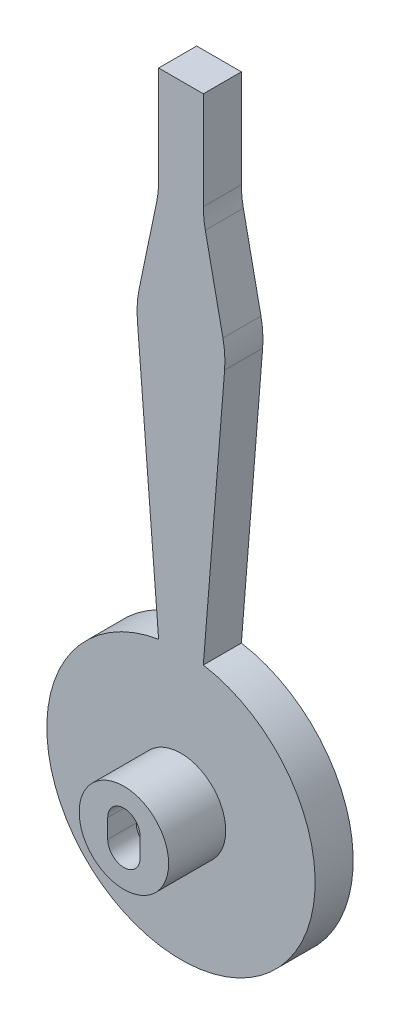
ISO-10303-21;
HEADER;
FILE_DESCRIPTION(('STEP AP214'),'2;1');
FILE_NAME('part.step','',(''),(''),'','','');
FILE_SCHEMA(('AUTOMOTIVE_DESIGN { 1 0 10303 214 1 1 1 1 }'));
ENDSEC;
DATA;
#1=APPLICATION_CONTEXT('core data for automotive mechanical design processes');
#2=APPLICATION_PROTOCOL_DEFINITION('international standard','automotive_design',2000,#1);
#3=PRODUCT_CONTEXT('',#1,'mechanical');
#4=PRODUCT('Part','Part','',(#3));
#5=PRODUCT_RELATED_PRODUCT_CATEGORY('part','',(#4));
#6=PRODUCT_DEFINITION_FORMATION('','',#4);
#7=PRODUCT_DEFINITION_CONTEXT('part definition',#1,'design');
#8=PRODUCT_DEFINITION('design','',#6,#7);
#9=PRODUCT_DEFINITION_SHAPE('','',#8);
#10=(LENGTH_UNIT() NAMED_UNIT(*) SI_UNIT(.MILLI.,.METRE.));
#11=(NAMED_UNIT(*) PLANE_ANGLE_UNIT() SI_UNIT($,.RADIAN.));
#12=(NAMED_UNIT(*) SI_UNIT($,.STERADIAN.) SOLID_ANGLE_UNIT());
#13=UNCERTAINTY_MEASURE_WITH_UNIT(LENGTH_MEASURE(1.E-05),#10,'distance_accuracy_value','');
#14=(GEOMETRIC_REPRESENTATION_CONTEXT(3) GLOBAL_UNCERTAINTY_ASSIGNED_CONTEXT((#13)) GLOBAL_UNIT_ASSIGNED_CONTEXT((#10,
#11,#12)) REPRESENTATION_CONTEXT('',''));
#15=CARTESIAN_POINT('',(0.,0.,0.));
#16=DIRECTION('',(0.,0.,1.));
#17=DIRECTION('',(1.,0.,0.));
#18=AXIS2_PLACEMENT_3D('',#15,#16,#17);
#19=CARTESIAN_POINT('',(0.,65.9,4.));
#20=DIRECTION('',(0.,1.,0.));
#21=DIRECTION('',(0.,0.,1.));
#22=AXIS2_PLACEMENT_3D('',#19,#20,#21);
#23=PLANE('',#22);
#24=DIRECTION('',(1.,0.,0.));
#25=VECTOR('',#24,1.);
#26=CARTESIAN_POINT('',(0.,65.9,0.));
#27=LINE('',#26,#25);
#28=CARTESIAN_POINT('',(-2.35,65.9,0.));
#29=VERTEX_POINT('',#28);
#30=CARTESIAN_POINT('',(2.35,65.9,0.));
#31=VERTEX_POINT('',#30);
#32=EDGE_CURVE('E169',#29,#31,#27,.T.);
#33=ORIENTED_EDGE('',*,*,#32,.F.);
#34=DIRECTION('',(0.,0.,-1.));
#35=VECTOR('',#34,1.);
#36=CARTESIAN_POINT('',(-2.35,65.9,4.));
#37=LINE('',#36,#35);
#38=CARTESIAN_POINT('',(-2.35,65.9,4.));
#39=VERTEX_POINT('',#38);
#40=EDGE_CURVE('E11',#39,#29,#37,.T.);
#41=ORIENTED_EDGE('',*,*,#40,.F.);
#42=DIRECTION('',(1.,0.,0.));
#43=VECTOR('',#42,1.);
#44=CARTESIAN_POINT('',(0.,65.9,4.));
#45=LINE('',#44,#43);
#46=CARTESIAN_POINT('',(2.35,65.9,4.));
#47=VERTEX_POINT('',#46);
#48=EDGE_CURVE('E201',#39,#47,#45,.T.);
#49=ORIENTED_EDGE('',*,*,#48,.T.);
#50=DIRECTION('',(0.,0.,-1.));
#51=VECTOR('',#50,1.);
#52=CARTESIAN_POINT('',(2.35,65.9,4.));
#53=LINE('',#52,#51);
#54=EDGE_CURVE('E59',#47,#31,#53,.T.);
#55=ORIENTED_EDGE('',*,*,#54,.T.);
#56=EDGE_LOOP('',(#33,#41,#49,#55));
#57=FACE_BOUND('',#56,.T.);
#58=ADVANCED_FACE('F36',(#57),#23,.T.);
#59=CARTESIAN_POINT('',(-2.3500000000005,0.,4.));
#60=DIRECTION('',(-1.,0.,0.));
#61=DIRECTION('',(0.,-1.,0.));
#62=AXIS2_PLACEMENT_3D('',#59,#60,#61);
#63=PLANE('',#62);
#64=DIRECTION('',(0.,1.,0.));
#65=VECTOR('',#64,1.);
#66=CARTESIAN_POINT('',(-2.3500000000005,0.,0.));
#67=LINE('',#66,#65);
#68=CARTESIAN_POINT('',(-2.35000000000008,55.6253357668643,0.));
#69=VERTEX_POINT('',#68);
#70=EDGE_CURVE('E171',#69,#29,#67,.T.);
#71=ORIENTED_EDGE('',*,*,#70,.F.);
#72=DIRECTION('',(0.,0.,-1.));
#73=VECTOR('',#72,1.);
#74=CARTESIAN_POINT('',(-2.35000000000008,55.6253357668643,4.));
#75=LINE('',#74,#73);
#76=CARTESIAN_POINT('',(-2.35000000000008,55.6253357668643,4.));
#77=VERTEX_POINT('',#76);
#78=EDGE_CURVE('E43',#77,#69,#75,.T.);
#79=ORIENTED_EDGE('',*,*,#78,.F.);
#80=DIRECTION('',(0.,1.,0.));
#81=VECTOR('',#80,1.);
#82=CARTESIAN_POINT('',(-2.3500000000005,0.,4.));
#83=LINE('',#82,#81);
#84=EDGE_CURVE('E232',#77,#39,#83,.T.);
#85=ORIENTED_EDGE('',*,*,#84,.T.);
#86=ORIENTED_EDGE('',*,*,#40,.T.);
#87=EDGE_LOOP('',(#71,#79,#85,#86));
#88=FACE_BOUND('',#87,.T.);
#89=ADVANCED_FACE('F231',(#88),#63,.T.);
#90=CARTESIAN_POINT('',(-12.35,55.6253357668643,4.));
#91=DIRECTION('',(0.,0.,-1.));
#92=DIRECTION('',(-1.,0.,0.));
#93=AXIS2_PLACEMENT_3D('',#90,#91,#92);
#94=CYLINDRICAL_SURFACE('',#93,9.99999999999992);
#95=CARTESIAN_POINT('',(-12.35,55.6253357668643,0.));
#96=DIRECTION('',(0.,0.,1.));
#97=DIRECTION('',(1.,0.,0.));
#98=AXIS2_PLACEMENT_3D('',#95,#96,#97);
#99=CIRCLE('',#98,9.99999999999992);
#100=CARTESIAN_POINT('',(-2.55936084221021,53.5898051525154,0.));
#101=VERTEX_POINT('',#100);
#102=EDGE_CURVE('E175',#69,#101,#99,.F.);
#103=ORIENTED_EDGE('',*,*,#102,.T.);
#104=DIRECTION('',(0.,0.,-1.));
#105=VECTOR('',#104,1.);
#106=CARTESIAN_POINT('',(-2.55936084221021,53.5898051525154,4.));
#107=LINE('',#106,#105);
#108=CARTESIAN_POINT('',(-2.55936084221021,53.5898051525154,4.));
#109=VERTEX_POINT('',#108);
#110=EDGE_CURVE('E216',#109,#101,#107,.T.);
#111=ORIENTED_EDGE('',*,*,#110,.F.);
#112=CARTESIAN_POINT('',(-12.35,55.6253357668643,4.));
#113=DIRECTION('',(0.,0.,1.));
#114=DIRECTION('',(1.,0.,0.));
#115=AXIS2_PLACEMENT_3D('',#112,#113,#114);
#116=CIRCLE('',#115,9.99999999999992);
#117=EDGE_CURVE('E222',#77,#109,#116,.F.);
#118=ORIENTED_EDGE('',*,*,#117,.F.);
#119=ORIENTED_EDGE('',*,*,#78,.T.);
#120=EDGE_LOOP('',(#103,#111,#118,#119));
#121=FACE_BOUND('',#120,.T.);
#122=ADVANCED_FACE('F220',(#121),#94,.F.);
#123=CARTESIAN_POINT('',(-13.1333070424788,2.73049063720624,4.));
#124=DIRECTION('',(-0.979063915778987,0.203553061434893,0.));
#125=DIRECTION('',(-0.203553061434893,-0.979063915778987,0.));
#126=AXIS2_PLACEMENT_3D('',#123,#124,#125);
#127=PLANE('',#126);
#128=DIRECTION('',(0.203553061434893,0.979063915778987,0.));
#129=VECTOR('',#128,1.);
#130=CARTESIAN_POINT('',(-13.1333070424788,2.73049063720624,0.));
#131=LINE('',#130,#129);
#132=CARTESIAN_POINT('',(-4.40819343713173,44.6971593370033,0.));
#133=VERTEX_POINT('',#132);
#134=EDGE_CURVE('E178',#133,#101,#131,.T.);
#135=ORIENTED_EDGE('',*,*,#134,.F.);
#136=DIRECTION('',(0.,0.,-1.));
#137=VECTOR('',#136,1.);
#138=CARTESIAN_POINT('',(-4.40819343713173,44.6971593370033,4.));
#139=LINE('',#138,#137);
#140=CARTESIAN_POINT('',(-4.40819343713173,44.6971593370033,4.));
#141=VERTEX_POINT('',#140);
#142=EDGE_CURVE('E214',#141,#133,#139,.T.);
#143=ORIENTED_EDGE('',*,*,#142,.F.);
#144=DIRECTION('',(0.203553061434893,0.979063915778987,0.));
#145=VECTOR('',#144,1.);
#146=CARTESIAN_POINT('',(-13.1333070424788,2.73049063720624,4.));
#147=LINE('',#146,#145);
#148=EDGE_CURVE('E263',#141,#109,#147,.T.);
#149=ORIENTED_EDGE('',*,*,#148,.T.);
#150=ORIENTED_EDGE('',*,*,#110,.T.);
#151=EDGE_LOOP('',(#135,#143,#149,#150));
#152=FACE_BOUND('',#151,.T.);
#153=ADVANCED_FACE('F260',(#152),#127,.T.);
#154=CARTESIAN_POINT('',(5.38244572065814,42.6616287226543,4.));
#155=DIRECTION('',(0.,0.,-1.));
#156=DIRECTION('',(-1.,0.,0.));
#157=AXIS2_PLACEMENT_3D('',#154,#155,#156);
#158=CYLINDRICAL_SURFACE('',#157,10.);
#159=CARTESIAN_POINT('',(5.38244572065814,42.6616287226543,0.));
#160=DIRECTION('',(0.,0.,1.));
#161=DIRECTION('',(1.,0.,0.));
#162=AXIS2_PLACEMENT_3D('',#159,#160,#161);
#163=CIRCLE('',#162,10.);
#164=CARTESIAN_POINT('',(-4.58574117645546,41.8646030115178,0.));
#165=VERTEX_POINT('',#164);
#166=EDGE_CURVE('E181',#133,#165,#163,.T.);
#167=ORIENTED_EDGE('',*,*,#166,.T.);
#168=DIRECTION('',(0.,0.,-1.));
#169=VECTOR('',#168,1.);
#170=CARTESIAN_POINT('',(-4.58574117645546,41.8646030115178,4.));
#171=LINE('',#170,#169);
#172=CARTESIAN_POINT('',(-4.58574117645546,41.8646030115178,4.));
#173=VERTEX_POINT('',#172);
#174=EDGE_CURVE('E212',#173,#165,#171,.T.);
#175=ORIENTED_EDGE('',*,*,#174,.F.);
#176=CARTESIAN_POINT('',(5.38244572065814,42.6616287226543,4.));
#177=DIRECTION('',(0.,0.,1.));
#178=DIRECTION('',(1.,0.,0.));
#179=AXIS2_PLACEMENT_3D('',#176,#177,#178);
#180=CIRCLE('',#179,10.);
#181=EDGE_CURVE('E264',#141,#173,#180,.T.);
#182=ORIENTED_EDGE('',*,*,#181,.F.);
#183=ORIENTED_EDGE('',*,*,#142,.T.);
#184=EDGE_LOOP('',(#167,#175,#182,#183));
#185=FACE_BOUND('',#184,.T.);
#186=ADVANCED_FACE('F258',(#185),#158,.T.);
#187=CARTESIAN_POINT('',(-1.230508888213,-0.0983877240475712,4.));
#188=DIRECTION('',(-0.99681868971136,-0.0797025711136562,0.));
#189=DIRECTION('',(0.0797025711136562,-0.99681868971136,0.));
#190=AXIS2_PLACEMENT_3D('',#187,#188,#189);
#191=PLANE('',#190);
#192=DIRECTION('',(-0.0797025711136562,0.99681868971136,0.));
#193=VECTOR('',#192,1.);
#194=CARTESIAN_POINT('',(-1.230508888213,-0.0983877240475712,0.));
#195=LINE('',#194,#193);
#196=CARTESIAN_POINT('',(-2.35,13.9027874902841,0.));
#197=VERTEX_POINT('',#196);
#198=EDGE_CURVE('E184',#197,#165,#195,.T.);
#199=ORIENTED_EDGE('',*,*,#198,.F.);
#200=DIRECTION('',(0.,0.,-1.));
#201=VECTOR('',#200,1.);
#202=CARTESIAN_POINT('',(-2.35,13.9027874902841,4.));
#203=LINE('',#202,#201);
#204=CARTESIAN_POINT('',(-2.35,13.9027874902841,4.));
#205=VERTEX_POINT('',#204);
#206=EDGE_CURVE('E210',#205,#197,#203,.T.);
#207=ORIENTED_EDGE('',*,*,#206,.F.);
#208=DIRECTION('',(-0.0797025711136562,0.99681868971136,0.));
#209=VECTOR('',#208,1.);
#210=CARTESIAN_POINT('',(-1.230508888213,-0.0983877240475712,4.));
#211=LINE('',#210,#209);
#212=EDGE_CURVE('E255',#205,#173,#211,.T.);
#213=ORIENTED_EDGE('',*,*,#212,.T.);
#214=ORIENTED_EDGE('',*,*,#174,.T.);
#215=EDGE_LOOP('',(#199,#207,#213,#214));
#216=FACE_BOUND('',#215,.T.);
#217=ADVANCED_FACE('F252',(#216),#191,.T.);
#218=CARTESIAN_POINT('',(0.,0.,4.));
#219=DIRECTION('',(0.,0.,-1.));
#220=DIRECTION('',(-1.,0.,0.));
#221=AXIS2_PLACEMENT_3D('',#218,#219,#220);
#222=CYLINDRICAL_SURFACE('',#221,14.1);
#223=CARTESIAN_POINT('',(0.,0.,0.));
#224=DIRECTION('',(0.,0.,1.));
#225=DIRECTION('',(1.,0.,0.));
#226=AXIS2_PLACEMENT_3D('',#223,#224,#225);
#227=CIRCLE('',#226,14.1);
#228=CARTESIAN_POINT('',(2.35,13.9027874902841,0.));
#229=VERTEX_POINT('',#228);
#230=EDGE_CURVE('E187',#197,#229,#227,.T.);
#231=ORIENTED_EDGE('',*,*,#230,.T.);
#232=DIRECTION('',(0.,0.,-1.));
#233=VECTOR('',#232,1.);
#234=CARTESIAN_POINT('',(2.35,13.9027874902841,4.));
#235=LINE('',#234,#233);
#236=CARTESIAN_POINT('',(2.35,13.9027874902841,4.));
#237=VERTEX_POINT('',#236);
#238=EDGE_CURVE('E207',#237,#229,#235,.T.);
#239=ORIENTED_EDGE('',*,*,#238,.F.);
#240=CARTESIAN_POINT('',(0.,0.,4.));
#241=DIRECTION('',(0.,0.,1.));
#242=DIRECTION('',(1.,0.,0.));
#243=AXIS2_PLACEMENT_3D('',#240,#241,#242);
#244=CIRCLE('',#243,14.1);
#245=EDGE_CURVE('E248',#205,#237,#244,.T.);
#246=ORIENTED_EDGE('',*,*,#245,.F.);
#247=ORIENTED_EDGE('',*,*,#206,.T.);
#248=EDGE_LOOP('',(#231,#239,#246,#247));
#249=FACE_BOUND('',#248,.T.);
#250=ADVANCED_FACE('F247',(#249),#222,.T.);
#251=CARTESIAN_POINT('',(1.230508888213,-0.0983877240475711,4.));
#252=DIRECTION('',(-0.99681868971136,0.0797025711136564,0.));
#253=DIRECTION('',(-0.0797025711136564,-0.99681868971136,0.));
#254=AXIS2_PLACEMENT_3D('',#251,#252,#253);
#255=PLANE('',#254);
#256=DIRECTION('',(0.0797025711136564,0.99681868971136,0.));
#257=VECTOR('',#256,1.);
#258=CARTESIAN_POINT('',(1.230508888213,-0.0983877240475711,0.));
#259=LINE('',#258,#257);
#260=CARTESIAN_POINT('',(4.58574117645545,41.8646030115177,0.));
#261=VERTEX_POINT('',#260);
#262=EDGE_CURVE('E189',#229,#261,#259,.T.);
#263=ORIENTED_EDGE('',*,*,#262,.T.);
#264=DIRECTION('',(0.,0.,-1.));
#265=VECTOR('',#264,1.);
#266=CARTESIAN_POINT('',(4.58574117645545,41.8646030115177,4.));
#267=LINE('',#266,#265);
#268=CARTESIAN_POINT('',(4.58574117645545,41.8646030115177,4.));
#269=VERTEX_POINT('',#268);
#270=EDGE_CURVE('E205',#269,#261,#267,.T.);
#271=ORIENTED_EDGE('',*,*,#270,.F.);
#272=DIRECTION('',(0.0797025711136564,0.99681868971136,0.));
#273=VECTOR('',#272,1.);
#274=CARTESIAN_POINT('',(1.230508888213,-0.0983877240475711,4.));
#275=LINE('',#274,#273);
#276=EDGE_CURVE('E244',#237,#269,#275,.T.);
#277=ORIENTED_EDGE('',*,*,#276,.F.);
#278=ORIENTED_EDGE('',*,*,#238,.T.);
#279=EDGE_LOOP('',(#263,#271,#277,#278));
#280=FACE_BOUND('',#279,.T.);
#281=ADVANCED_FACE('F242',(#280),#255,.F.);
#282=CARTESIAN_POINT('',(-5.38244572065814,42.6616287226543,4.));
#283=DIRECTION('',(0.,0.,-1.));
#284=DIRECTION('',(-1.,0.,0.));
#285=AXIS2_PLACEMENT_3D('',#282,#283,#284);
#286=CYLINDRICAL_SURFACE('',#285,9.99999999999999);
#287=CARTESIAN_POINT('',(-5.38244572065814,42.6616287226543,0.));
#288=DIRECTION('',(0.,0.,1.));
#289=DIRECTION('',(1.,0.,0.));
#290=AXIS2_PLACEMENT_3D('',#287,#288,#289);
#291=CIRCLE('',#290,9.99999999999999);
#292=CARTESIAN_POINT('',(4.40819343713169,44.6971593370033,0.));
#293=VERTEX_POINT('',#292);
#294=EDGE_CURVE('E192',#293,#261,#291,.F.);
#295=ORIENTED_EDGE('',*,*,#294,.F.);
#296=DIRECTION('',(0.,0.,-1.));
#297=VECTOR('',#296,1.);
#298=CARTESIAN_POINT('',(4.40819343713169,44.6971593370033,4.));
#299=LINE('',#298,#297);
#300=CARTESIAN_POINT('',(4.40819343713169,44.6971593370033,4.));
#301=VERTEX_POINT('',#300);
#302=EDGE_CURVE('E147',#301,#293,#299,.T.);
#303=ORIENTED_EDGE('',*,*,#302,.F.);
#304=CARTESIAN_POINT('',(-5.38244572065814,42.6616287226543,4.));
#305=DIRECTION('',(0.,0.,1.));
#306=DIRECTION('',(1.,0.,0.));
#307=AXIS2_PLACEMENT_3D('',#304,#305,#306);
#308=CIRCLE('',#307,9.99999999999999);
#309=EDGE_CURVE('E158',#301,#269,#308,.F.);
#310=ORIENTED_EDGE('',*,*,#309,.T.);
#311=ORIENTED_EDGE('',*,*,#270,.T.);
#312=EDGE_LOOP('',(#295,#303,#310,#311));
#313=FACE_BOUND('',#312,.T.);
#314=ADVANCED_FACE('F238',(#313),#286,.T.);
#315=CARTESIAN_POINT('',(13.1333070424795,2.73049063720662,4.));
#316=DIRECTION('',(0.979063915778983,0.203553061434911,0.));
#317=DIRECTION('',(-0.203553061434911,0.979063915778983,0.));
#318=AXIS2_PLACEMENT_3D('',#315,#316,#317);
#319=PLANE('',#318);
#320=DIRECTION('',(0.203553061434911,-0.979063915778983,0.));
#321=VECTOR('',#320,1.);
#322=CARTESIAN_POINT('',(13.1333070424795,2.73049063720662,0.));
#323=LINE('',#322,#321);
#324=CARTESIAN_POINT('',(2.55936084221005,53.5898051525152,0.));
#325=VERTEX_POINT('',#324);
#326=EDGE_CURVE('E142',#325,#293,#323,.T.);
#327=ORIENTED_EDGE('',*,*,#326,.F.);
#328=DIRECTION('',(0.,0.,-1.));
#329=VECTOR('',#328,1.);
#330=CARTESIAN_POINT('',(2.55936084221005,53.5898051525152,4.));
#331=LINE('',#330,#329);
#332=CARTESIAN_POINT('',(2.55936084221005,53.5898051525152,4.));
#333=VERTEX_POINT('',#332);
#334=EDGE_CURVE('E137',#333,#325,#331,.T.);
#335=ORIENTED_EDGE('',*,*,#334,.F.);
#336=DIRECTION('',(0.203553061434911,-0.979063915778983,0.));
#337=VECTOR('',#336,1.);
#338=CARTESIAN_POINT('',(13.1333070424795,2.73049063720662,4.));
#339=LINE('',#338,#337);
#340=EDGE_CURVE('E140',#333,#301,#339,.T.);
#341=ORIENTED_EDGE('',*,*,#340,.T.);
#342=ORIENTED_EDGE('',*,*,#302,.T.);
#343=EDGE_LOOP('',(#327,#335,#341,#342));
#344=FACE_BOUND('',#343,.T.);
#345=ADVANCED_FACE('F139',(#344),#319,.T.);
#346=CARTESIAN_POINT('',(12.35,55.6253357668643,4.));
#347=DIRECTION('',(0.,0.,-1.));
#348=DIRECTION('',(-1.,0.,0.));
#349=AXIS2_PLACEMENT_3D('',#346,#347,#348);
#350=CYLINDRICAL_SURFACE('',#349,10.0000000000001);
#351=CARTESIAN_POINT('',(12.35,55.6253357668643,0.));
#352=DIRECTION('',(0.,0.,1.));
#353=DIRECTION('',(1.,0.,0.));
#354=AXIS2_PLACEMENT_3D('',#351,#352,#353);
#355=CIRCLE('',#354,10.0000000000001);
#356=CARTESIAN_POINT('',(2.34999999999988,55.6253357668643,0.));
#357=VERTEX_POINT('',#356);
#358=EDGE_CURVE('E196',#357,#325,#355,.T.);
#359=ORIENTED_EDGE('',*,*,#358,.F.);
#360=DIRECTION('',(0.,0.,-1.));
#361=VECTOR('',#360,1.);
#362=CARTESIAN_POINT('',(2.34999999999988,55.6253357668643,4.));
#363=LINE('',#362,#361);
#364=CARTESIAN_POINT('',(2.34999999999988,55.6253357668643,4.));
#365=VERTEX_POINT('',#364);
#366=EDGE_CURVE('E148',#365,#357,#363,.T.);
#367=ORIENTED_EDGE('',*,*,#366,.F.);
#368=CARTESIAN_POINT('',(12.35,55.6253357668643,4.));
#369=DIRECTION('',(0.,0.,1.));
#370=DIRECTION('',(1.,0.,0.));
#371=AXIS2_PLACEMENT_3D('',#368,#369,#370);
#372=CIRCLE('',#371,10.0000000000001);
#373=EDGE_CURVE('E156',#365,#333,#372,.T.);
#374=ORIENTED_EDGE('',*,*,#373,.T.);
#375=ORIENTED_EDGE('',*,*,#334,.T.);
#376=EDGE_LOOP('',(#359,#367,#374,#375));
#377=FACE_BOUND('',#376,.T.);
#378=ADVANCED_FACE('F160',(#377),#350,.F.);
#379=CARTESIAN_POINT('',(2.34999999999924,0.,4.));
#380=DIRECTION('',(1.,0.,0.));
#381=DIRECTION('',(0.,1.,0.));
#382=AXIS2_PLACEMENT_3D('',#379,#380,#381);
#383=PLANE('',#382);
#384=DIRECTION('',(0.,-1.,0.));
#385=VECTOR('',#384,1.);
#386=CARTESIAN_POINT('',(2.34999999999924,0.,0.));
#387=LINE('',#386,#385);
#388=EDGE_CURVE('E198',#31,#357,#387,.T.);
#389=ORIENTED_EDGE('',*,*,#388,.F.);
#390=ORIENTED_EDGE('',*,*,#54,.F.);
#391=DIRECTION('',(0.,-1.,0.));
#392=VECTOR('',#391,1.);
#393=CARTESIAN_POINT('',(2.34999999999924,0.,4.));
#394=LINE('',#393,#392);
#395=EDGE_CURVE('E161',#47,#365,#394,.T.);
#396=ORIENTED_EDGE('',*,*,#395,.T.);
#397=ORIENTED_EDGE('',*,*,#366,.T.);
#398=EDGE_LOOP('',(#389,#390,#396,#397));
#399=FACE_BOUND('',#398,.T.);
#400=ADVANCED_FACE('F233',(#399),#383,.T.);
#401=CARTESIAN_POINT('',(0.,0.,4.));
#402=DIRECTION('',(0.,0.,1.));
#403=DIRECTION('',(1.,0.,0.));
#404=AXIS2_PLACEMENT_3D('',#401,#402,#403);
#405=PLANE('',#404);
#406=ORIENTED_EDGE('',*,*,#48,.F.);
#407=ORIENTED_EDGE('',*,*,#84,.F.);
#408=ORIENTED_EDGE('',*,*,#117,.T.);
#409=ORIENTED_EDGE('',*,*,#148,.F.);
#410=ORIENTED_EDGE('',*,*,#181,.T.);
#411=ORIENTED_EDGE('',*,*,#212,.F.);
#412=ORIENTED_EDGE('',*,*,#245,.T.);
#413=ORIENTED_EDGE('',*,*,#276,.T.);
#414=ORIENTED_EDGE('',*,*,#309,.F.);
#415=ORIENTED_EDGE('',*,*,#340,.F.);
#416=ORIENTED_EDGE('',*,*,#373,.F.);
#417=ORIENTED_EDGE('',*,*,#395,.F.);
#418=EDGE_LOOP('',(#406,#407,#408,#409,#410,#411,#412,#413,#414,#415,#416,#417));
#419=FACE_BOUND('',#418,.T.);
#420=CARTESIAN_POINT('',(0.,0.,4.));
#421=DIRECTION('',(0.,0.,1.));
#422=DIRECTION('',(1.,0.,0.));
#423=AXIS2_PLACEMENT_3D('',#420,#421,#422);
#424=CIRCLE('',#423,4.7);
#425=CARTESIAN_POINT('',(4.7,0.,4.));
#426=VERTEX_POINT('',#425);
#427=EDGE_CURVE('E163',#426,#426,#424,.T.);
#428=ORIENTED_EDGE('',*,*,#427,.F.);
#429=EDGE_LOOP('',(#428));
#430=FACE_BOUND('',#429,.T.);
#431=ADVANCED_FACE('F153',(#419,#430),#405,.T.);
#432=CARTESIAN_POINT('',(0.,0.,0.));
#433=DIRECTION('',(0.,0.,1.));
#434=DIRECTION('',(1.,0.,0.));
#435=AXIS2_PLACEMENT_3D('',#432,#433,#434);
#436=PLANE('',#435);
#437=ORIENTED_EDGE('',*,*,#32,.T.);
#438=ORIENTED_EDGE('',*,*,#388,.T.);
#439=ORIENTED_EDGE('',*,*,#358,.T.);
#440=ORIENTED_EDGE('',*,*,#326,.T.);
#441=ORIENTED_EDGE('',*,*,#294,.T.);
#442=ORIENTED_EDGE('',*,*,#262,.F.);
#443=ORIENTED_EDGE('',*,*,#230,.F.);
#444=ORIENTED_EDGE('',*,*,#198,.T.);
#445=ORIENTED_EDGE('',*,*,#166,.F.);
#446=ORIENTED_EDGE('',*,*,#134,.T.);
#447=ORIENTED_EDGE('',*,*,#102,.F.);
#448=ORIENTED_EDGE('',*,*,#70,.T.);
#449=EDGE_LOOP('',(#437,#438,#439,#440,#441,#442,#443,#444,#445,#446,#447,#448));
#450=FACE_BOUND('',#449,.T.);
#451=ADVANCED_FACE('F228',(#450),#436,.F.);
#452=CARTESIAN_POINT('',(0.,0.,10.));
#453=DIRECTION('',(0.,0.,-1.));
#454=DIRECTION('',(-1.,0.,0.));
#455=AXIS2_PLACEMENT_3D('',#452,#453,#454);
#456=CYLINDRICAL_SURFACE('',#455,4.7);
#457=ORIENTED_EDGE('',*,*,#427,.T.);
#458=EDGE_LOOP('',(#457));
#459=FACE_BOUND('',#458,.T.);
#460=CARTESIAN_POINT('',(0.,0.,10.));
#461=DIRECTION('',(0.,0.,1.));
#462=DIRECTION('',(1.,0.,0.));
#463=AXIS2_PLACEMENT_3D('',#460,#461,#462);
#464=CIRCLE('',#463,4.7);
#465=CARTESIAN_POINT('',(4.7,0.,10.));
#466=VERTEX_POINT('',#465);
#467=EDGE_CURVE('E172',#466,#466,#464,.T.);
#468=ORIENTED_EDGE('',*,*,#467,.F.);
#469=EDGE_LOOP('',(#468));
#470=FACE_BOUND('',#469,.T.);
#471=ADVANCED_FACE('F377',(#459,#470),#456,.T.);
#472=CARTESIAN_POINT('',(0.,0.,10.));
#473=DIRECTION('',(0.,0.,1.));
#474=DIRECTION('',(1.,0.,0.));
#475=AXIS2_PLACEMENT_3D('',#472,#473,#474);
#476=PLANE('',#475);
#477=CARTESIAN_POINT('',(0.,1.,10.));
#478=DIRECTION('',(0.,0.,1.));
#479=DIRECTION('',(1.,0.,0.));
#480=AXIS2_PLACEMENT_3D('',#477,#478,#479);
#481=CIRCLE('',#480,1.7);
#482=CARTESIAN_POINT('',(1.7,1.,10.));
#483=VERTEX_POINT('',#482);
#484=CARTESIAN_POINT('',(-1.7,1.,10.));
#485=VERTEX_POINT('',#484);
#486=EDGE_CURVE('E50',#483,#485,#481,.T.);
#487=ORIENTED_EDGE('',*,*,#486,.F.);
#488=DIRECTION('',(0.,1.,0.));
#489=VECTOR('',#488,1.);
#490=CARTESIAN_POINT('',(1.7,1.,10.));
#491=LINE('',#490,#489);
#492=CARTESIAN_POINT('',(1.7,-1.,10.));
#493=VERTEX_POINT('',#492);
#494=EDGE_CURVE('E287',#493,#483,#491,.T.);
#495=ORIENTED_EDGE('',*,*,#494,.F.);
#496=CARTESIAN_POINT('',(0.,-1.,10.));
#497=DIRECTION('',(0.,0.,1.));
#498=DIRECTION('',(1.,0.,0.));
#499=AXIS2_PLACEMENT_3D('',#496,#497,#498);
#500=CIRCLE('',#499,1.7);
#501=CARTESIAN_POINT('',(-1.7,-1.,10.));
#502=VERTEX_POINT('',#501);
#503=EDGE_CURVE('E291',#502,#493,#500,.T.);
#504=ORIENTED_EDGE('',*,*,#503,.F.);
#505=DIRECTION('',(0.,-1.,0.));
#506=VECTOR('',#505,1.);
#507=CARTESIAN_POINT('',(-1.7,1.,10.));
#508=LINE('',#507,#506);
#509=EDGE_CURVE('E294',#485,#502,#508,.T.);
#510=ORIENTED_EDGE('',*,*,#509,.F.);
#511=EDGE_LOOP('',(#487,#495,#504,#510));
#512=FACE_BOUND('',#511,.T.);
#513=ORIENTED_EDGE('',*,*,#467,.T.);
#514=EDGE_LOOP('',(#513));
#515=FACE_BOUND('',#514,.T.);
#516=ADVANCED_FACE('F335',(#512,#515),#476,.T.);
#517=CARTESIAN_POINT('',(0.,1.,7.));
#518=DIRECTION('',(0.,0.,1.));
#519=DIRECTION('',(1.,0.,0.));
#520=AXIS2_PLACEMENT_3D('',#517,#518,#519);
#521=CYLINDRICAL_SURFACE('',#520,1.7);
#522=ORIENTED_EDGE('',*,*,#486,.T.);
#523=DIRECTION('',(0.,0.,1.));
#524=VECTOR('',#523,1.);
#525=CARTESIAN_POINT('',(-1.7,1.,7.));
#526=LINE('',#525,#524);
#527=CARTESIAN_POINT('',(-1.7,1.,7.));
#528=VERTEX_POINT('',#527);
#529=EDGE_CURVE('E277',#528,#485,#526,.T.);
#530=ORIENTED_EDGE('',*,*,#529,.F.);
#531=CARTESIAN_POINT('',(0.,1.,7.));
#532=DIRECTION('',(0.,0.,1.));
#533=DIRECTION('',(1.,0.,0.));
#534=AXIS2_PLACEMENT_3D('',#531,#532,#533);
#535=CIRCLE('',#534,1.7);
#536=CARTESIAN_POINT('',(1.7,1.,7.));
#537=VERTEX_POINT('',#536);
#538=EDGE_CURVE('E290',#537,#528,#535,.T.);
#539=ORIENTED_EDGE('',*,*,#538,.F.);
#540=DIRECTION('',(0.,0.,1.));
#541=VECTOR('',#540,1.);
#542=CARTESIAN_POINT('',(1.7,1.,7.));
#543=LINE('',#542,#541);
#544=EDGE_CURVE('E276',#537,#483,#543,.T.);
#545=ORIENTED_EDGE('',*,*,#544,.T.);
#546=EDGE_LOOP('',(#522,#530,#539,#545));
#547=FACE_BOUND('',#546,.T.);
#548=ADVANCED_FACE('F315',(#547),#521,.F.);
#549=CARTESIAN_POINT('',(1.7,1.,7.));
#550=DIRECTION('',(1.,0.,0.));
#551=DIRECTION('',(0.,0.,-1.));
#552=AXIS2_PLACEMENT_3D('',#549,#550,#551);
#553=PLANE('',#552);
#554=ORIENTED_EDGE('',*,*,#494,.T.);
#555=ORIENTED_EDGE('',*,*,#544,.F.);
#556=DIRECTION('',(0.,1.,0.));
#557=VECTOR('',#556,1.);
#558=CARTESIAN_POINT('',(1.7,1.,7.));
#559=LINE('',#558,#557);
#560=CARTESIAN_POINT('',(1.7,-1.,7.));
#561=VERTEX_POINT('',#560);
#562=EDGE_CURVE('E280',#561,#537,#559,.T.);
#563=ORIENTED_EDGE('',*,*,#562,.F.);
#564=DIRECTION('',(0.,0.,1.));
#565=VECTOR('',#564,1.);
#566=CARTESIAN_POINT('',(1.7,-1.,7.));
#567=LINE('',#566,#565);
#568=EDGE_CURVE('E283',#561,#493,#567,.T.);
#569=ORIENTED_EDGE('',*,*,#568,.T.);
#570=EDGE_LOOP('',(#554,#555,#563,#569));
#571=FACE_BOUND('',#570,.T.);
#572=ADVANCED_FACE('F326',(#571),#553,.F.);
#573=CARTESIAN_POINT('',(0.,-1.,7.));
#574=DIRECTION('',(0.,0.,1.));
#575=DIRECTION('',(1.,0.,0.));
#576=AXIS2_PLACEMENT_3D('',#573,#574,#575);
#577=CYLINDRICAL_SURFACE('',#576,1.7);
#578=ORIENTED_EDGE('',*,*,#503,.T.);
#579=ORIENTED_EDGE('',*,*,#568,.F.);
#580=CARTESIAN_POINT('',(0.,-1.,7.));
#581=DIRECTION('',(0.,0.,1.));
#582=DIRECTION('',(1.,0.,0.));
#583=AXIS2_PLACEMENT_3D('',#580,#581,#582);
#584=CIRCLE('',#583,1.7);
#585=CARTESIAN_POINT('',(-1.7,-1.,7.));
#586=VERTEX_POINT('',#585);
#587=EDGE_CURVE('E300',#586,#561,#584,.T.);
#588=ORIENTED_EDGE('',*,*,#587,.F.);
#589=DIRECTION('',(0.,0.,1.));
#590=VECTOR('',#589,1.);
#591=CARTESIAN_POINT('',(-1.7,-1.,7.));
#592=LINE('',#591,#590);
#593=EDGE_CURVE('E279',#586,#502,#592,.T.);
#594=ORIENTED_EDGE('',*,*,#593,.T.);
#595=EDGE_LOOP('',(#578,#579,#588,#594));
#596=FACE_BOUND('',#595,.T.);
#597=ADVANCED_FACE('F331',(#596),#577,.F.);
#598=CARTESIAN_POINT('',(-1.7,1.,7.));
#599=DIRECTION('',(-1.,0.,0.));
#600=DIRECTION('',(0.,0.,1.));
#601=AXIS2_PLACEMENT_3D('',#598,#599,#600);
#602=PLANE('',#601);
#603=ORIENTED_EDGE('',*,*,#509,.T.);
#604=ORIENTED_EDGE('',*,*,#593,.F.);
#605=DIRECTION('',(0.,-1.,0.));
#606=VECTOR('',#605,1.);
#607=CARTESIAN_POINT('',(-1.7,1.,7.));
#608=LINE('',#607,#606);
#609=EDGE_CURVE('E303',#528,#586,#608,.T.);
#610=ORIENTED_EDGE('',*,*,#609,.F.);
#611=ORIENTED_EDGE('',*,*,#529,.T.);
#612=EDGE_LOOP('',(#603,#604,#610,#611));
#613=FACE_BOUND('',#612,.T.);
#614=ADVANCED_FACE('F338',(#613),#602,.F.);
#615=CARTESIAN_POINT('',(0.,1.,7.));
#616=DIRECTION('',(0.,0.,1.));
#617=DIRECTION('',(1.,0.,0.));
#618=AXIS2_PLACEMENT_3D('',#615,#616,#617);
#619=PLANE('',#618);
#620=ORIENTED_EDGE('',*,*,#538,.T.);
#621=ORIENTED_EDGE('',*,*,#609,.T.);
#622=ORIENTED_EDGE('',*,*,#587,.T.);
#623=ORIENTED_EDGE('',*,*,#562,.T.);
#624=EDGE_LOOP('',(#620,#621,#622,#623));
#625=FACE_BOUND('',#624,.T.);
#626=ADVANCED_FACE('F310',(#625),#619,.T.);
#627=CLOSED_SHELL('',(#58,#89,#122,#153,#186,#217,#250,#281,#314,#345,#378,#400,#431,#451,#471,
#516,#548,#572,#597,#614,#626));
#628=MANIFOLD_SOLID_BREP('B2',#627);
#629=ADVANCED_BREP_SHAPE_REPRESENTATION('',(#18,#628),#14);
#630=SHAPE_DEFINITION_REPRESENTATION(#9,#629);
ENDSEC;
END-ISO-10303-21;
